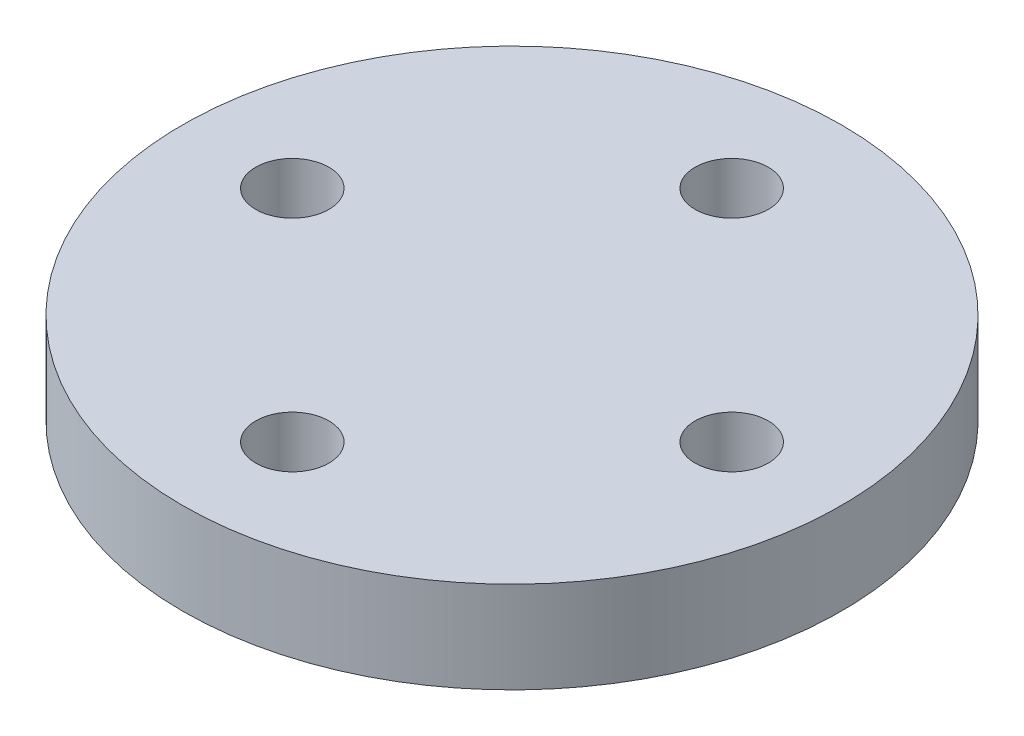
ISO-10303-21;
HEADER;
FILE_DESCRIPTION(('STEP AP214'),'2;1');
FILE_NAME('part.step','',(''),(''),'','','');
FILE_SCHEMA(('AUTOMOTIVE_DESIGN { 1 0 10303 214 1 1 1 1 }'));
ENDSEC;
DATA;
#1=APPLICATION_CONTEXT('core data for automotive mechanical design processes');
#2=APPLICATION_PROTOCOL_DEFINITION('international standard','automotive_design',2000,#1);
#3=PRODUCT_CONTEXT('',#1,'mechanical');
#4=PRODUCT('Part','Part','',(#3));
#5=PRODUCT_RELATED_PRODUCT_CATEGORY('part','',(#4));
#6=PRODUCT_DEFINITION_FORMATION('','',#4);
#7=PRODUCT_DEFINITION_CONTEXT('part definition',#1,'design');
#8=PRODUCT_DEFINITION('design','',#6,#7);
#9=PRODUCT_DEFINITION_SHAPE('','',#8);
#10=(LENGTH_UNIT() NAMED_UNIT(*) SI_UNIT(.MILLI.,.METRE.));
#11=(NAMED_UNIT(*) PLANE_ANGLE_UNIT() SI_UNIT($,.RADIAN.));
#12=(NAMED_UNIT(*) SI_UNIT($,.STERADIAN.) SOLID_ANGLE_UNIT());
#13=UNCERTAINTY_MEASURE_WITH_UNIT(LENGTH_MEASURE(1.E-05),#10,'distance_accuracy_value','');
#14=(GEOMETRIC_REPRESENTATION_CONTEXT(3) GLOBAL_UNCERTAINTY_ASSIGNED_CONTEXT((#13)) GLOBAL_UNIT_ASSIGNED_CONTEXT((#10,
#11,#12)) REPRESENTATION_CONTEXT('',''));
#15=CARTESIAN_POINT('',(0.,0.,0.));
#16=DIRECTION('',(0.,0.,1.));
#17=DIRECTION('',(1.,0.,0.));
#18=AXIS2_PLACEMENT_3D('',#15,#16,#17);
#19=CARTESIAN_POINT('',(0.,5.,-12.));
#20=DIRECTION('',(0.,-1.,0.));
#21=DIRECTION('',(0.,0.,-1.));
#22=AXIS2_PLACEMENT_3D('',#19,#20,#21);
#23=CYLINDRICAL_SURFACE('',#22,2.);
#24=CARTESIAN_POINT('',(0.,5.,-12.));
#25=DIRECTION('',(0.,1.,0.));
#26=DIRECTION('',(0.,0.,1.));
#27=AXIS2_PLACEMENT_3D('',#24,#25,#26);
#28=CIRCLE('',#27,2.);
#29=CARTESIAN_POINT('',(0.,5.,-10.));
#30=VERTEX_POINT('',#29);
#31=EDGE_CURVE('E50',#30,#30,#28,.T.);
#32=ORIENTED_EDGE('',*,*,#31,.T.);
#33=EDGE_LOOP('',(#32));
#34=FACE_BOUND('',#33,.T.);
#35=CARTESIAN_POINT('',(0.,0.,-12.));
#36=DIRECTION('',(0.,1.,0.));
#37=DIRECTION('',(0.,0.,1.));
#38=AXIS2_PLACEMENT_3D('',#35,#36,#37);
#39=CIRCLE('',#38,2.);
#40=CARTESIAN_POINT('',(0.,0.,-10.));
#41=VERTEX_POINT('',#40);
#42=EDGE_CURVE('E71',#41,#41,#39,.T.);
#43=ORIENTED_EDGE('',*,*,#42,.F.);
#44=EDGE_LOOP('',(#43));
#45=FACE_BOUND('',#44,.T.);
#46=ADVANCED_FACE('F41',(#34,#45),#23,.F.);
#47=CARTESIAN_POINT('',(12.,5.,0.));
#48=DIRECTION('',(0.,-1.,0.));
#49=DIRECTION('',(0.,0.,-1.));
#50=AXIS2_PLACEMENT_3D('',#47,#48,#49);
#51=CYLINDRICAL_SURFACE('',#50,2.);
#52=CARTESIAN_POINT('',(12.,5.,0.));
#53=DIRECTION('',(0.,1.,0.));
#54=DIRECTION('',(0.,0.,1.));
#55=AXIS2_PLACEMENT_3D('',#52,#53,#54);
#56=CIRCLE('',#55,2.);
#57=CARTESIAN_POINT('',(12.,5.,2.));
#58=VERTEX_POINT('',#57);
#59=EDGE_CURVE('E56',#58,#58,#56,.T.);
#60=ORIENTED_EDGE('',*,*,#59,.T.);
#61=EDGE_LOOP('',(#60));
#62=FACE_BOUND('',#61,.T.);
#63=CARTESIAN_POINT('',(12.,0.,0.));
#64=DIRECTION('',(0.,1.,0.));
#65=DIRECTION('',(0.,0.,1.));
#66=AXIS2_PLACEMENT_3D('',#63,#64,#65);
#67=CIRCLE('',#66,2.);
#68=CARTESIAN_POINT('',(12.,0.,2.));
#69=VERTEX_POINT('',#68);
#70=EDGE_CURVE('E68',#69,#69,#67,.T.);
#71=ORIENTED_EDGE('',*,*,#70,.F.);
#72=EDGE_LOOP('',(#71));
#73=FACE_BOUND('',#72,.T.);
#74=ADVANCED_FACE('F94',(#62,#73),#51,.F.);
#75=CARTESIAN_POINT('',(0.,5.,12.));
#76=DIRECTION('',(0.,-1.,0.));
#77=DIRECTION('',(0.,0.,-1.));
#78=AXIS2_PLACEMENT_3D('',#75,#76,#77);
#79=CYLINDRICAL_SURFACE('',#78,2.);
#80=CARTESIAN_POINT('',(0.,5.,12.));
#81=DIRECTION('',(0.,1.,0.));
#82=DIRECTION('',(0.,0.,1.));
#83=AXIS2_PLACEMENT_3D('',#80,#81,#82);
#84=CIRCLE('',#83,2.);
#85=CARTESIAN_POINT('',(0.,5.,14.));
#86=VERTEX_POINT('',#85);
#87=EDGE_CURVE('E83',#86,#86,#84,.T.);
#88=ORIENTED_EDGE('',*,*,#87,.T.);
#89=EDGE_LOOP('',(#88));
#90=FACE_BOUND('',#89,.T.);
#91=CARTESIAN_POINT('',(0.,0.,12.));
#92=DIRECTION('',(0.,1.,0.));
#93=DIRECTION('',(0.,0.,1.));
#94=AXIS2_PLACEMENT_3D('',#91,#92,#93);
#95=CIRCLE('',#94,2.);
#96=CARTESIAN_POINT('',(0.,0.,14.));
#97=VERTEX_POINT('',#96);
#98=EDGE_CURVE('E64',#97,#97,#95,.T.);
#99=ORIENTED_EDGE('',*,*,#98,.F.);
#100=EDGE_LOOP('',(#99));
#101=FACE_BOUND('',#100,.T.);
#102=ADVANCED_FACE('F112',(#90,#101),#79,.F.);
#103=CARTESIAN_POINT('',(-12.,5.,0.));
#104=DIRECTION('',(0.,-1.,0.));
#105=DIRECTION('',(0.,0.,-1.));
#106=AXIS2_PLACEMENT_3D('',#103,#104,#105);
#107=CYLINDRICAL_SURFACE('',#106,2.);
#108=CARTESIAN_POINT('',(-12.,5.,0.));
#109=DIRECTION('',(0.,1.,0.));
#110=DIRECTION('',(0.,0.,1.));
#111=AXIS2_PLACEMENT_3D('',#108,#109,#110);
#112=CIRCLE('',#111,2.);
#113=CARTESIAN_POINT('',(-12.,5.,1.99999999999992));
#114=VERTEX_POINT('',#113);
#115=EDGE_CURVE('E78',#114,#114,#112,.T.);
#116=ORIENTED_EDGE('',*,*,#115,.T.);
#117=EDGE_LOOP('',(#116));
#118=FACE_BOUND('',#117,.T.);
#119=CARTESIAN_POINT('',(-12.,0.,0.));
#120=DIRECTION('',(0.,1.,0.));
#121=DIRECTION('',(0.,0.,1.));
#122=AXIS2_PLACEMENT_3D('',#119,#120,#121);
#123=CIRCLE('',#122,2.);
#124=CARTESIAN_POINT('',(-12.,0.,1.99999999999992));
#125=VERTEX_POINT('',#124);
#126=EDGE_CURVE('E60',#125,#125,#123,.T.);
#127=ORIENTED_EDGE('',*,*,#126,.F.);
#128=EDGE_LOOP('',(#127));
#129=FACE_BOUND('',#128,.T.);
#130=ADVANCED_FACE('F43',(#118,#129),#107,.F.);
#131=CARTESIAN_POINT('',(0.,5.,0.));
#132=DIRECTION('',(0.,-1.,0.));
#133=DIRECTION('',(0.,0.,-1.));
#134=AXIS2_PLACEMENT_3D('',#131,#132,#133);
#135=CYLINDRICAL_SURFACE('',#134,18.);
#136=CARTESIAN_POINT('',(0.,5.,0.));
#137=DIRECTION('',(0.,1.,0.));
#138=DIRECTION('',(0.,0.,1.));
#139=AXIS2_PLACEMENT_3D('',#136,#137,#138);
#140=CIRCLE('',#139,18.);
#141=CARTESIAN_POINT('',(0.,5.,18.));
#142=VERTEX_POINT('',#141);
#143=EDGE_CURVE('E10',#142,#142,#140,.T.);
#144=ORIENTED_EDGE('',*,*,#143,.F.);
#145=EDGE_LOOP('',(#144));
#146=FACE_BOUND('',#145,.T.);
#147=CARTESIAN_POINT('',(0.,0.,0.));
#148=DIRECTION('',(0.,1.,0.));
#149=DIRECTION('',(0.,0.,1.));
#150=AXIS2_PLACEMENT_3D('',#147,#148,#149);
#151=CIRCLE('',#150,18.);
#152=CARTESIAN_POINT('',(0.,0.,18.));
#153=VERTEX_POINT('',#152);
#154=EDGE_CURVE('E45',#153,#153,#151,.T.);
#155=ORIENTED_EDGE('',*,*,#154,.T.);
#156=EDGE_LOOP('',(#155));
#157=FACE_BOUND('',#156,.T.);
#158=ADVANCED_FACE('F101',(#146,#157),#135,.T.);
#159=CARTESIAN_POINT('',(0.,5.,0.));
#160=DIRECTION('',(0.,1.,0.));
#161=DIRECTION('',(0.,0.,1.));
#162=AXIS2_PLACEMENT_3D('',#159,#160,#161);
#163=PLANE('',#162);
#164=ORIENTED_EDGE('',*,*,#115,.F.);
#165=EDGE_LOOP('',(#164));
#166=FACE_BOUND('',#165,.T.);
#167=ORIENTED_EDGE('',*,*,#87,.F.);
#168=EDGE_LOOP('',(#167));
#169=FACE_BOUND('',#168,.T.);
#170=ORIENTED_EDGE('',*,*,#59,.F.);
#171=EDGE_LOOP('',(#170));
#172=FACE_BOUND('',#171,.T.);
#173=ORIENTED_EDGE('',*,*,#31,.F.);
#174=EDGE_LOOP('',(#173));
#175=FACE_BOUND('',#174,.T.);
#176=ORIENTED_EDGE('',*,*,#143,.T.);
#177=EDGE_LOOP('',(#176));
#178=FACE_BOUND('',#177,.T.);
#179=ADVANCED_FACE('F97',(#166,#169,#172,#175,#178),#163,.T.);
#180=CARTESIAN_POINT('',(0.,0.,0.));
#181=DIRECTION('',(0.,1.,0.));
#182=DIRECTION('',(0.,0.,1.));
#183=AXIS2_PLACEMENT_3D('',#180,#181,#182);
#184=PLANE('',#183);
#185=ORIENTED_EDGE('',*,*,#126,.T.);
#186=EDGE_LOOP('',(#185));
#187=FACE_BOUND('',#186,.T.);
#188=ORIENTED_EDGE('',*,*,#98,.T.);
#189=EDGE_LOOP('',(#188));
#190=FACE_BOUND('',#189,.T.);
#191=ORIENTED_EDGE('',*,*,#70,.T.);
#192=EDGE_LOOP('',(#191));
#193=FACE_BOUND('',#192,.T.);
#194=ORIENTED_EDGE('',*,*,#42,.T.);
#195=EDGE_LOOP('',(#194));
#196=FACE_BOUND('',#195,.T.);
#197=ORIENTED_EDGE('',*,*,#154,.F.);
#198=EDGE_LOOP('',(#197));
#199=FACE_BOUND('',#198,.T.);
#200=ADVANCED_FACE('F100',(#187,#190,#193,#196,#199),#184,.F.);
#201=CLOSED_SHELL('',(#46,#74,#102,#130,#158,#179,#200));
#202=MANIFOLD_SOLID_BREP('B2',#201);
#203=ADVANCED_BREP_SHAPE_REPRESENTATION('',(#18,#202),#14);
#204=SHAPE_DEFINITION_REPRESENTATION(#9,#203);
ENDSEC;
END-ISO-10303-21;
